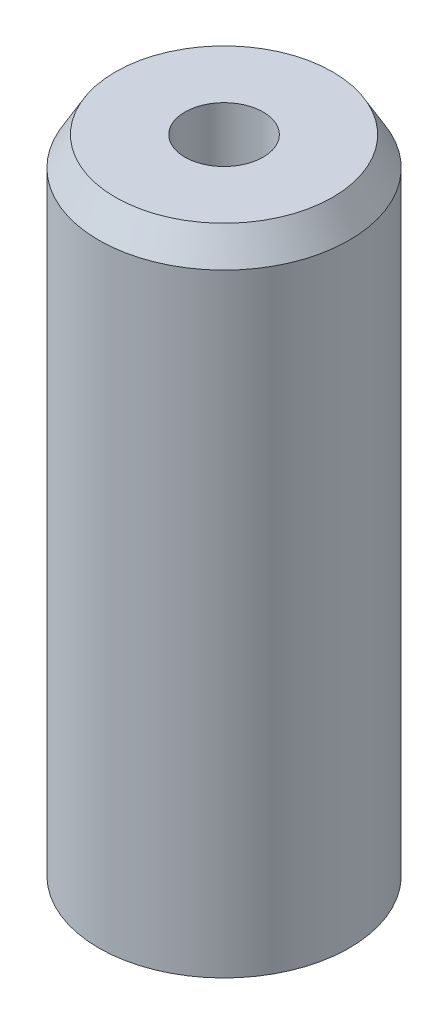
ISO-10303-21;
HEADER;
FILE_DESCRIPTION(('STEP AP214'),'2;1');
FILE_NAME('part.step','',(''),(''),'','','');
FILE_SCHEMA(('AUTOMOTIVE_DESIGN { 1 0 10303 214 1 1 1 1 }'));
ENDSEC;
DATA;
#1=APPLICATION_CONTEXT('core data for automotive mechanical design processes');
#2=APPLICATION_PROTOCOL_DEFINITION('international standard','automotive_design',2000,#1);
#3=PRODUCT_CONTEXT('',#1,'mechanical');
#4=PRODUCT('Part','Part','',(#3));
#5=PRODUCT_RELATED_PRODUCT_CATEGORY('part','',(#4));
#6=PRODUCT_DEFINITION_FORMATION('','',#4);
#7=PRODUCT_DEFINITION_CONTEXT('part definition',#1,'design');
#8=PRODUCT_DEFINITION('design','',#6,#7);
#9=PRODUCT_DEFINITION_SHAPE('','',#8);
#10=(LENGTH_UNIT() NAMED_UNIT(*) SI_UNIT(.MILLI.,.METRE.));
#11=(NAMED_UNIT(*) PLANE_ANGLE_UNIT() SI_UNIT($,.RADIAN.));
#12=(NAMED_UNIT(*) SI_UNIT($,.STERADIAN.) SOLID_ANGLE_UNIT());
#13=UNCERTAINTY_MEASURE_WITH_UNIT(LENGTH_MEASURE(1.E-05),#10,'distance_accuracy_value','');
#14=(GEOMETRIC_REPRESENTATION_CONTEXT(3) GLOBAL_UNCERTAINTY_ASSIGNED_CONTEXT((#13)) GLOBAL_UNIT_ASSIGNED_CONTEXT((#10,
#11,#12)) REPRESENTATION_CONTEXT('',''));
#15=CARTESIAN_POINT('',(0.,0.,0.));
#16=DIRECTION('',(0.,0.,1.));
#17=DIRECTION('',(1.,0.,0.));
#18=AXIS2_PLACEMENT_3D('',#15,#16,#17);
#19=CARTESIAN_POINT('',(0.,65.6975145277561,0.));
#20=DIRECTION('',(0.,-1.,0.));
#21=DIRECTION('',(0.,0.,-1.));
#22=AXIS2_PLACEMENT_3D('',#19,#20,#21);
#23=CYLINDRICAL_SURFACE('',#22,12.5);
#24=CARTESIAN_POINT('',(0.,62.8213314123812,0.));
#25=DIRECTION('',(0.,1.,0.));
#26=DIRECTION('',(0.,0.,1.));
#27=AXIS2_PLACEMENT_3D('',#24,#25,#26);
#28=CIRCLE('',#27,12.5);
#29=CARTESIAN_POINT('',(0.,62.8213314123812,12.5));
#30=VERTEX_POINT('',#29);
#31=EDGE_CURVE('E50',#30,#30,#28,.F.);
#32=ORIENTED_EDGE('',*,*,#31,.T.);
#33=EDGE_LOOP('',(#32));
#34=FACE_BOUND('',#33,.T.);
#35=CARTESIAN_POINT('',(0.,1.66056509590037,0.));
#36=DIRECTION('',(0.,1.,0.));
#37=DIRECTION('',(0.,0.,1.));
#38=AXIS2_PLACEMENT_3D('',#35,#36,#37);
#39=CIRCLE('',#38,12.5);
#40=CARTESIAN_POINT('',(0.,1.66056509590037,12.5));
#41=VERTEX_POINT('',#40);
#42=EDGE_CURVE('E51',#41,#41,#39,.T.);
#43=ORIENTED_EDGE('',*,*,#42,.T.);
#44=EDGE_LOOP('',(#43));
#45=FACE_BOUND('',#44,.T.);
#46=ADVANCED_FACE('F39',(#34,#45),#23,.T.);
#47=CARTESIAN_POINT('',(0.,65.6975145277561,0.));
#48=DIRECTION('',(0.,1.,0.));
#49=DIRECTION('',(0.,0.,1.));
#50=AXIS2_PLACEMENT_3D('',#47,#48,#49);
#51=PLANE('',#50);
#52=CARTESIAN_POINT('',(0.,65.6975145277561,0.));
#53=DIRECTION('',(0.,1.,0.));
#54=DIRECTION('',(0.,0.,1.));
#55=AXIS2_PLACEMENT_3D('',#52,#53,#54);
#56=CIRCLE('',#55,10.8394349040996);
#57=CARTESIAN_POINT('',(0.,65.6975145277561,10.8394349040996));
#58=VERTEX_POINT('',#57);
#59=EDGE_CURVE('E54',#58,#58,#56,.T.);
#60=ORIENTED_EDGE('',*,*,#59,.T.);
#61=EDGE_LOOP('',(#60));
#62=FACE_BOUND('',#61,.T.);
#63=CARTESIAN_POINT('',(0.,65.6975145277561,0.));
#64=DIRECTION('',(0.,1.,0.));
#65=DIRECTION('',(0.,0.,1.));
#66=AXIS2_PLACEMENT_3D('',#63,#64,#65);
#67=CIRCLE('',#66,3.90523450372506);
#68=CARTESIAN_POINT('',(0.,65.6975145277561,3.90523450372506));
#69=VERTEX_POINT('',#68);
#70=EDGE_CURVE('E58',#69,#69,#67,.T.);
#71=ORIENTED_EDGE('',*,*,#70,.F.);
#72=EDGE_LOOP('',(#71));
#73=FACE_BOUND('',#72,.T.);
#74=ADVANCED_FACE('F69',(#62,#73),#51,.T.);
#75=CARTESIAN_POINT('',(0.,0.,0.));
#76=DIRECTION('',(0.,1.,0.));
#77=DIRECTION('',(0.,0.,1.));
#78=AXIS2_PLACEMENT_3D('',#75,#76,#77);
#79=PLANE('',#78);
#80=CARTESIAN_POINT('',(0.,0.,0.));
#81=DIRECTION('',(0.,1.,0.));
#82=DIRECTION('',(0.,0.,1.));
#83=AXIS2_PLACEMENT_3D('',#80,#81,#82);
#84=CIRCLE('',#83,9.62381688462504);
#85=CARTESIAN_POINT('',(0.,0.,9.62381688462504));
#86=VERTEX_POINT('',#85);
#87=EDGE_CURVE('E10',#86,#86,#84,.F.);
#88=ORIENTED_EDGE('',*,*,#87,.T.);
#89=EDGE_LOOP('',(#88));
#90=FACE_BOUND('',#89,.T.);
#91=CARTESIAN_POINT('',(0.,0.,0.));
#92=DIRECTION('',(0.,1.,0.));
#93=DIRECTION('',(0.,0.,1.));
#94=AXIS2_PLACEMENT_3D('',#91,#92,#93);
#95=CIRCLE('',#94,3.90523450372506);
#96=CARTESIAN_POINT('',(0.,0.,3.90523450372506));
#97=VERTEX_POINT('',#96);
#98=EDGE_CURVE('E63',#97,#97,#95,.T.);
#99=ORIENTED_EDGE('',*,*,#98,.T.);
#100=EDGE_LOOP('',(#99));
#101=FACE_BOUND('',#100,.T.);
#102=ADVANCED_FACE('F75',(#90,#101),#79,.F.);
#103=CARTESIAN_POINT('',(0.,65.6975145277561,0.));
#104=DIRECTION('',(0.,-1.,0.));
#105=DIRECTION('',(0.,0.,-1.));
#106=AXIS2_PLACEMENT_3D('',#103,#104,#105);
#107=CYLINDRICAL_SURFACE('',#106,3.90523450372506);
#108=ORIENTED_EDGE('',*,*,#70,.T.);
#109=EDGE_LOOP('',(#108));
#110=FACE_BOUND('',#109,.T.);
#111=ORIENTED_EDGE('',*,*,#98,.F.);
#112=EDGE_LOOP('',(#111));
#113=FACE_BOUND('',#112,.T.);
#114=ADVANCED_FACE('F70',(#110,#113),#107,.F.);
#115=CARTESIAN_POINT('',(0.,65.6975145277561,0.));
#116=DIRECTION('',(0.,-1.,0.));
#117=DIRECTION('',(0.,0.,-1.));
#118=AXIS2_PLACEMENT_3D('',#115,#116,#117);
#119=CONICAL_SURFACE('',#118,10.8394349040996,0.523598775598293);
#120=ORIENTED_EDGE('',*,*,#31,.F.);
#121=EDGE_LOOP('',(#120));
#122=FACE_BOUND('',#121,.T.);
#123=ORIENTED_EDGE('',*,*,#59,.F.);
#124=EDGE_LOOP('',(#123));
#125=FACE_BOUND('',#124,.T.);
#126=ADVANCED_FACE('F81',(#122,#125),#119,.T.);
#127=CARTESIAN_POINT('',(0.,1.66056509590037,0.));
#128=DIRECTION('',(0.,1.,0.));
#129=DIRECTION('',(0.,0.,1.));
#130=AXIS2_PLACEMENT_3D('',#127,#128,#129);
#131=CONICAL_SURFACE('',#130,12.5,1.0471975511966);
#132=ORIENTED_EDGE('',*,*,#87,.F.);
#133=EDGE_LOOP('',(#132));
#134=FACE_BOUND('',#133,.T.);
#135=ORIENTED_EDGE('',*,*,#42,.F.);
#136=EDGE_LOOP('',(#135));
#137=FACE_BOUND('',#136,.T.);
#138=ADVANCED_FACE('F45',(#134,#137),#131,.T.);
#139=CLOSED_SHELL('',(#46,#74,#102,#114,#126,#138));
#140=MANIFOLD_SOLID_BREP('B2',#139);
#141=ADVANCED_BREP_SHAPE_REPRESENTATION('',(#18,#140),#14);
#142=SHAPE_DEFINITION_REPRESENTATION(#9,#141);
ENDSEC;
END-ISO-10303-21;
